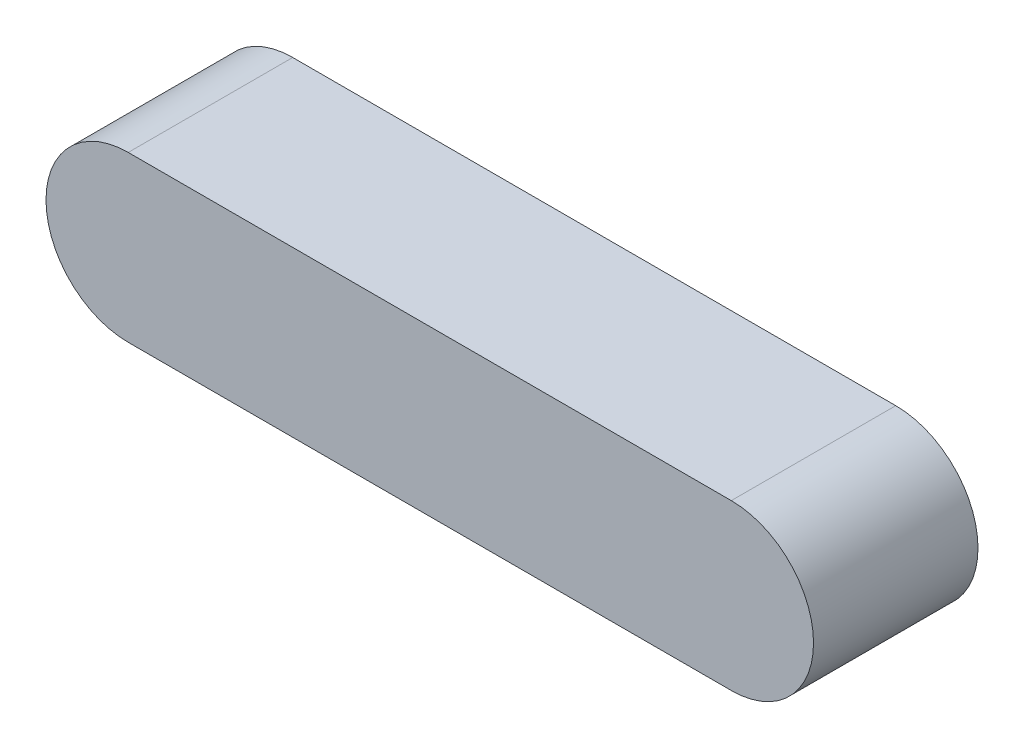
ISO-10303-21;
HEADER;
FILE_DESCRIPTION(('STEP AP214'),'2;1');
FILE_NAME('part.step','',(''),(''),'','','');
FILE_SCHEMA(('AUTOMOTIVE_DESIGN { 1 0 10303 214 1 1 1 1 }'));
ENDSEC;
DATA;
#1=APPLICATION_CONTEXT('core data for automotive mechanical design processes');
#2=APPLICATION_PROTOCOL_DEFINITION('international standard','automotive_design',2000,#1);
#3=PRODUCT_CONTEXT('',#1,'mechanical');
#4=PRODUCT('Part','Part','',(#3));
#5=PRODUCT_RELATED_PRODUCT_CATEGORY('part','',(#4));
#6=PRODUCT_DEFINITION_FORMATION('','',#4);
#7=PRODUCT_DEFINITION_CONTEXT('part definition',#1,'design');
#8=PRODUCT_DEFINITION('design','',#6,#7);
#9=PRODUCT_DEFINITION_SHAPE('','',#8);
#10=(LENGTH_UNIT() NAMED_UNIT(*) SI_UNIT(.MILLI.,.METRE.));
#11=(NAMED_UNIT(*) PLANE_ANGLE_UNIT() SI_UNIT($,.RADIAN.));
#12=(NAMED_UNIT(*) SI_UNIT($,.STERADIAN.) SOLID_ANGLE_UNIT());
#13=UNCERTAINTY_MEASURE_WITH_UNIT(LENGTH_MEASURE(1.E-05),#10,'distance_accuracy_value','');
#14=(GEOMETRIC_REPRESENTATION_CONTEXT(3) GLOBAL_UNCERTAINTY_ASSIGNED_CONTEXT((#13)) GLOBAL_UNIT_ASSIGNED_CONTEXT((#10,
#11,#12)) REPRESENTATION_CONTEXT('',''));
#15=CARTESIAN_POINT('',(0.,0.,0.));
#16=DIRECTION('',(0.,0.,1.));
#17=DIRECTION('',(1.,0.,0.));
#18=AXIS2_PLACEMENT_3D('',#15,#16,#17);
#19=CARTESIAN_POINT('',(0.,0.,3.));
#20=DIRECTION('',(0.,0.,-1.));
#21=DIRECTION('',(-1.,0.,0.));
#22=AXIS2_PLACEMENT_3D('',#19,#20,#21);
#23=CYLINDRICAL_SURFACE('',#22,1.5);
#24=CARTESIAN_POINT('',(0.,0.,0.));
#25=DIRECTION('',(0.,0.,1.));
#26=DIRECTION('',(1.,0.,0.));
#27=AXIS2_PLACEMENT_3D('',#24,#25,#26);
#28=CIRCLE('',#27,1.5);
#29=CARTESIAN_POINT('',(0.,1.5,0.));
#30=VERTEX_POINT('',#29);
#31=CARTESIAN_POINT('',(0.,-1.5,0.));
#32=VERTEX_POINT('',#31);
#33=EDGE_CURVE('E113',#30,#32,#28,.T.);
#34=ORIENTED_EDGE('',*,*,#33,.T.);
#35=DIRECTION('',(0.,0.,-1.));
#36=VECTOR('',#35,1.);
#37=CARTESIAN_POINT('',(0.,-1.5,3.));
#38=LINE('',#37,#36);
#39=CARTESIAN_POINT('',(0.,-1.5,3.));
#40=VERTEX_POINT('',#39);
#41=EDGE_CURVE('E11',#40,#32,#38,.T.);
#42=ORIENTED_EDGE('',*,*,#41,.F.);
#43=CARTESIAN_POINT('',(0.,0.,3.));
#44=DIRECTION('',(0.,0.,1.));
#45=DIRECTION('',(1.,0.,0.));
#46=AXIS2_PLACEMENT_3D('',#43,#44,#45);
#47=CIRCLE('',#46,1.5);
#48=CARTESIAN_POINT('',(0.,1.5,3.));
#49=VERTEX_POINT('',#48);
#50=EDGE_CURVE('E97',#49,#40,#47,.T.);
#51=ORIENTED_EDGE('',*,*,#50,.F.);
#52=DIRECTION('',(0.,0.,-1.));
#53=VECTOR('',#52,1.);
#54=CARTESIAN_POINT('',(0.,1.5,3.));
#55=LINE('',#54,#53);
#56=EDGE_CURVE('E109',#49,#30,#55,.T.);
#57=ORIENTED_EDGE('',*,*,#56,.T.);
#58=EDGE_LOOP('',(#34,#42,#51,#57));
#59=FACE_BOUND('',#58,.T.);
#60=ADVANCED_FACE('F45',(#59),#23,.T.);
#61=CARTESIAN_POINT('',(0.,-1.5,3.));
#62=DIRECTION('',(0.,1.,0.));
#63=DIRECTION('',(0.,0.,1.));
#64=AXIS2_PLACEMENT_3D('',#61,#62,#63);
#65=PLANE('',#64);
#66=DIRECTION('',(1.,0.,0.));
#67=VECTOR('',#66,1.);
#68=CARTESIAN_POINT('',(0.,-1.5,0.));
#69=LINE('',#68,#67);
#70=CARTESIAN_POINT('',(11.,-1.5,0.));
#71=VERTEX_POINT('',#70);
#72=EDGE_CURVE('E102',#32,#71,#69,.T.);
#73=ORIENTED_EDGE('',*,*,#72,.T.);
#74=DIRECTION('',(0.,0.,-1.));
#75=VECTOR('',#74,1.);
#76=CARTESIAN_POINT('',(11.,-1.5,3.));
#77=LINE('',#76,#75);
#78=CARTESIAN_POINT('',(11.,-1.5,3.));
#79=VERTEX_POINT('',#78);
#80=EDGE_CURVE('E54',#79,#71,#77,.T.);
#81=ORIENTED_EDGE('',*,*,#80,.F.);
#82=DIRECTION('',(1.,0.,0.));
#83=VECTOR('',#82,1.);
#84=CARTESIAN_POINT('',(0.,-1.5,3.));
#85=LINE('',#84,#83);
#86=EDGE_CURVE('E92',#40,#79,#85,.T.);
#87=ORIENTED_EDGE('',*,*,#86,.F.);
#88=ORIENTED_EDGE('',*,*,#41,.T.);
#89=EDGE_LOOP('',(#73,#81,#87,#88));
#90=FACE_BOUND('',#89,.T.);
#91=ADVANCED_FACE('F101',(#90),#65,.F.);
#92=CARTESIAN_POINT('',(11.,0.,3.));
#93=DIRECTION('',(0.,0.,-1.));
#94=DIRECTION('',(-1.,0.,0.));
#95=AXIS2_PLACEMENT_3D('',#92,#93,#94);
#96=CYLINDRICAL_SURFACE('',#95,1.5);
#97=CARTESIAN_POINT('',(11.,0.,0.));
#98=DIRECTION('',(0.,0.,1.));
#99=DIRECTION('',(1.,0.,0.));
#100=AXIS2_PLACEMENT_3D('',#97,#98,#99);
#101=CIRCLE('',#100,1.5);
#102=CARTESIAN_POINT('',(11.,1.5,0.));
#103=VERTEX_POINT('',#102);
#104=EDGE_CURVE('E79',#71,#103,#101,.T.);
#105=ORIENTED_EDGE('',*,*,#104,.T.);
#106=DIRECTION('',(0.,0.,-1.));
#107=VECTOR('',#106,1.);
#108=CARTESIAN_POINT('',(11.,1.5,3.));
#109=LINE('',#108,#107);
#110=CARTESIAN_POINT('',(11.,1.5,3.));
#111=VERTEX_POINT('',#110);
#112=EDGE_CURVE('E104',#111,#103,#109,.T.);
#113=ORIENTED_EDGE('',*,*,#112,.F.);
#114=CARTESIAN_POINT('',(11.,0.,3.));
#115=DIRECTION('',(0.,0.,1.));
#116=DIRECTION('',(1.,0.,0.));
#117=AXIS2_PLACEMENT_3D('',#114,#115,#116);
#118=CIRCLE('',#117,1.5);
#119=EDGE_CURVE('E95',#79,#111,#118,.T.);
#120=ORIENTED_EDGE('',*,*,#119,.F.);
#121=ORIENTED_EDGE('',*,*,#80,.T.);
#122=EDGE_LOOP('',(#105,#113,#120,#121));
#123=FACE_BOUND('',#122,.T.);
#124=ADVANCED_FACE('F105',(#123),#96,.T.);
#125=CARTESIAN_POINT('',(0.,1.5,3.));
#126=DIRECTION('',(0.,-1.,0.));
#127=DIRECTION('',(0.,0.,-1.));
#128=AXIS2_PLACEMENT_3D('',#125,#126,#127);
#129=PLANE('',#128);
#130=DIRECTION('',(-1.,0.,0.));
#131=VECTOR('',#130,1.);
#132=CARTESIAN_POINT('',(0.,1.5,0.));
#133=LINE('',#132,#131);
#134=EDGE_CURVE('E85',#103,#30,#133,.T.);
#135=ORIENTED_EDGE('',*,*,#134,.T.);
#136=ORIENTED_EDGE('',*,*,#56,.F.);
#137=DIRECTION('',(-1.,0.,0.));
#138=VECTOR('',#137,1.);
#139=CARTESIAN_POINT('',(0.,1.5,3.));
#140=LINE('',#139,#138);
#141=EDGE_CURVE('E62',#111,#49,#140,.T.);
#142=ORIENTED_EDGE('',*,*,#141,.F.);
#143=ORIENTED_EDGE('',*,*,#112,.T.);
#144=EDGE_LOOP('',(#135,#136,#142,#143));
#145=FACE_BOUND('',#144,.T.);
#146=ADVANCED_FACE('F126',(#145),#129,.F.);
#147=CARTESIAN_POINT('',(0.,0.,3.));
#148=DIRECTION('',(0.,0.,1.));
#149=DIRECTION('',(1.,0.,0.));
#150=AXIS2_PLACEMENT_3D('',#147,#148,#149);
#151=PLANE('',#150);
#152=ORIENTED_EDGE('',*,*,#50,.T.);
#153=ORIENTED_EDGE('',*,*,#86,.T.);
#154=ORIENTED_EDGE('',*,*,#119,.T.);
#155=ORIENTED_EDGE('',*,*,#141,.T.);
#156=EDGE_LOOP('',(#152,#153,#154,#155));
#157=FACE_BOUND('',#156,.T.);
#158=ADVANCED_FACE('F93',(#157),#151,.T.);
#159=CARTESIAN_POINT('',(0.,0.,0.));
#160=DIRECTION('',(0.,0.,1.));
#161=DIRECTION('',(1.,0.,0.));
#162=AXIS2_PLACEMENT_3D('',#159,#160,#161);
#163=PLANE('',#162);
#164=ORIENTED_EDGE('',*,*,#33,.F.);
#165=ORIENTED_EDGE('',*,*,#134,.F.);
#166=ORIENTED_EDGE('',*,*,#104,.F.);
#167=ORIENTED_EDGE('',*,*,#72,.F.);
#168=EDGE_LOOP('',(#164,#165,#166,#167));
#169=FACE_BOUND('',#168,.T.);
#170=ADVANCED_FACE('F129',(#169),#163,.F.);
#171=CLOSED_SHELL('',(#60,#91,#124,#146,#158,#170));
#172=MANIFOLD_SOLID_BREP('B2',#171);
#173=ADVANCED_BREP_SHAPE_REPRESENTATION('',(#18,#172),#14);
#174=SHAPE_DEFINITION_REPRESENTATION(#9,#173);
ENDSEC;
END-ISO-10303-21;
